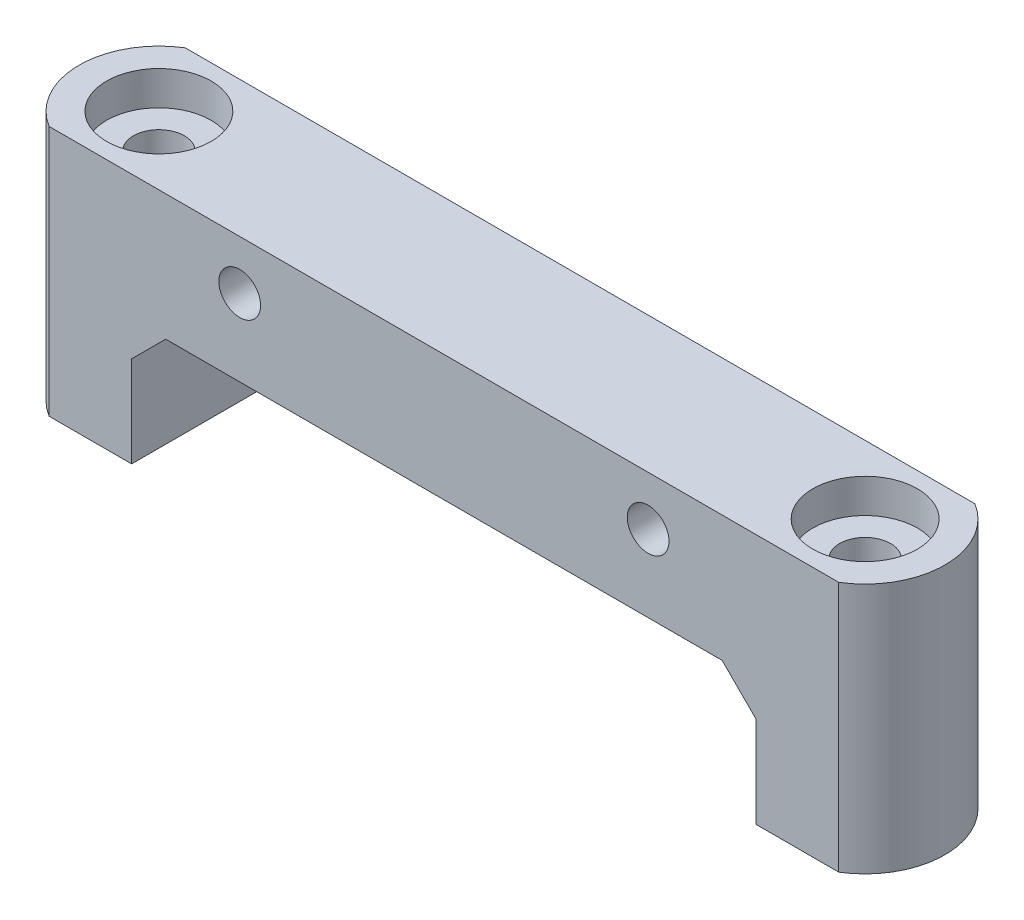
ISO-10303-21;
HEADER;
FILE_DESCRIPTION(('STEP AP214'),'2;1');
FILE_NAME('part.step','',(''),(''),'','','');
FILE_SCHEMA(('AUTOMOTIVE_DESIGN { 1 0 10303 214 1 1 1 1 }'));
ENDSEC;
DATA;
#1=APPLICATION_CONTEXT('core data for automotive mechanical design processes');
#2=APPLICATION_PROTOCOL_DEFINITION('international standard','automotive_design',2000,#1);
#3=PRODUCT_CONTEXT('',#1,'mechanical');
#4=PRODUCT('Part','Part','',(#3));
#5=PRODUCT_RELATED_PRODUCT_CATEGORY('part','',(#4));
#6=PRODUCT_DEFINITION_FORMATION('','',#4);
#7=PRODUCT_DEFINITION_CONTEXT('part definition',#1,'design');
#8=PRODUCT_DEFINITION('design','',#6,#7);
#9=PRODUCT_DEFINITION_SHAPE('','',#8);
#10=(LENGTH_UNIT() NAMED_UNIT(*) SI_UNIT(.MILLI.,.METRE.));
#11=(NAMED_UNIT(*) PLANE_ANGLE_UNIT() SI_UNIT($,.RADIAN.));
#12=(NAMED_UNIT(*) SI_UNIT($,.STERADIAN.) SOLID_ANGLE_UNIT());
#13=UNCERTAINTY_MEASURE_WITH_UNIT(LENGTH_MEASURE(1.E-05),#10,'distance_accuracy_value','');
#14=(GEOMETRIC_REPRESENTATION_CONTEXT(3) GLOBAL_UNCERTAINTY_ASSIGNED_CONTEXT((#13)) GLOBAL_UNIT_ASSIGNED_CONTEXT((#10,
#11,#12)) REPRESENTATION_CONTEXT('',''));
#15=CARTESIAN_POINT('',(0.,0.,0.));
#16=DIRECTION('',(0.,0.,1.));
#17=DIRECTION('',(1.,0.,0.));
#18=AXIS2_PLACEMENT_3D('',#15,#16,#17);
#19=CARTESIAN_POINT('',(-12.,11.85,8.));
#20=DIRECTION('',(0.,0.,-1.));
#21=DIRECTION('',(-1.,0.,0.));
#22=AXIS2_PLACEMENT_3D('',#19,#20,#21);
#23=CYLINDRICAL_SURFACE('',#22,1.);
#24=CARTESIAN_POINT('',(-12.,11.85,0.));
#25=DIRECTION('',(0.,0.,1.));
#26=DIRECTION('',(1.,0.,0.));
#27=AXIS2_PLACEMENT_3D('',#24,#25,#26);
#28=CIRCLE('',#27,1.);
#29=CARTESIAN_POINT('',(-11.,11.85,0.));
#30=VERTEX_POINT('',#29);
#31=EDGE_CURVE('E145',#30,#30,#28,.T.);
#32=ORIENTED_EDGE('',*,*,#31,.F.);
#33=EDGE_LOOP('',(#32));
#34=FACE_BOUND('',#33,.T.);
#35=CARTESIAN_POINT('',(-12.,11.85,3.));
#36=DIRECTION('',(0.,0.,1.));
#37=DIRECTION('',(1.,0.,0.));
#38=AXIS2_PLACEMENT_3D('',#35,#36,#37);
#39=CIRCLE('',#38,1.);
#40=CARTESIAN_POINT('',(-11.,11.85,3.));
#41=VERTEX_POINT('',#40);
#42=EDGE_CURVE('E37',#41,#41,#39,.T.);
#43=ORIENTED_EDGE('',*,*,#42,.T.);
#44=EDGE_LOOP('',(#43));
#45=FACE_BOUND('',#44,.T.);
#46=ADVANCED_FACE('F33',(#34,#45),#23,.F.);
#47=CARTESIAN_POINT('',(12.,11.85,8.));
#48=DIRECTION('',(0.,0.,-1.));
#49=DIRECTION('',(-1.,0.,0.));
#50=AXIS2_PLACEMENT_3D('',#47,#48,#49);
#51=CYLINDRICAL_SURFACE('',#50,1.);
#52=CARTESIAN_POINT('',(12.,11.85,0.));
#53=DIRECTION('',(0.,0.,1.));
#54=DIRECTION('',(1.,0.,0.));
#55=AXIS2_PLACEMENT_3D('',#52,#53,#54);
#56=CIRCLE('',#55,1.);
#57=CARTESIAN_POINT('',(13.,11.85,0.));
#58=VERTEX_POINT('',#57);
#59=EDGE_CURVE('E226',#58,#58,#56,.T.);
#60=ORIENTED_EDGE('',*,*,#59,.F.);
#61=EDGE_LOOP('',(#60));
#62=FACE_BOUND('',#61,.T.);
#63=CARTESIAN_POINT('',(12.,11.85,3.));
#64=DIRECTION('',(0.,0.,1.));
#65=DIRECTION('',(1.,0.,0.));
#66=AXIS2_PLACEMENT_3D('',#63,#64,#65);
#67=CIRCLE('',#66,1.);
#68=CARTESIAN_POINT('',(13.,11.85,3.));
#69=VERTEX_POINT('',#68);
#70=EDGE_CURVE('E193',#69,#69,#67,.T.);
#71=ORIENTED_EDGE('',*,*,#70,.T.);
#72=EDGE_LOOP('',(#71));
#73=FACE_BOUND('',#72,.T.);
#74=ADVANCED_FACE('F281',(#62,#73),#51,.F.);
#75=CARTESIAN_POINT('',(-20.75,14.75,4.));
#76=DIRECTION('',(0.,-1.,0.));
#77=DIRECTION('',(1.,0.,0.));
#78=AXIS2_PLACEMENT_3D('',#75,#76,#77);
#79=CYLINDRICAL_SURFACE('',#78,1.5);
#80=CARTESIAN_POINT('',(-20.75,0.,4.));
#81=DIRECTION('',(0.,-1.,0.));
#82=DIRECTION('',(1.,0.,0.));
#83=AXIS2_PLACEMENT_3D('',#80,#81,#82);
#84=CIRCLE('',#83,1.5);
#85=CARTESIAN_POINT('',(-19.25,0.,4.));
#86=VERTEX_POINT('',#85);
#87=EDGE_CURVE('E223',#86,#86,#84,.T.);
#88=ORIENTED_EDGE('',*,*,#87,.T.);
#89=EDGE_LOOP('',(#88));
#90=FACE_BOUND('',#89,.T.);
#91=CARTESIAN_POINT('',(-20.75,12.75,4.));
#92=DIRECTION('',(0.,1.,0.));
#93=DIRECTION('',(-1.,0.,0.));
#94=AXIS2_PLACEMENT_3D('',#91,#92,#93);
#95=CIRCLE('',#94,1.5);
#96=CARTESIAN_POINT('',(-22.25,12.75,4.));
#97=VERTEX_POINT('',#96);
#98=EDGE_CURVE('E171',#97,#97,#95,.F.);
#99=ORIENTED_EDGE('',*,*,#98,.F.);
#100=EDGE_LOOP('',(#99));
#101=FACE_BOUND('',#100,.T.);
#102=ADVANCED_FACE('F287',(#90,#101),#79,.F.);
#103=CARTESIAN_POINT('',(20.75,14.75,4.));
#104=DIRECTION('',(0.,-1.,0.));
#105=DIRECTION('',(1.,0.,0.));
#106=AXIS2_PLACEMENT_3D('',#103,#104,#105);
#107=CYLINDRICAL_SURFACE('',#106,1.5);
#108=CARTESIAN_POINT('',(20.75,0.,4.));
#109=DIRECTION('',(0.,-1.,0.));
#110=DIRECTION('',(1.,0.,0.));
#111=AXIS2_PLACEMENT_3D('',#108,#109,#110);
#112=CIRCLE('',#111,1.5);
#113=CARTESIAN_POINT('',(22.25,0.,4.));
#114=VERTEX_POINT('',#113);
#115=EDGE_CURVE('E221',#114,#114,#112,.T.);
#116=ORIENTED_EDGE('',*,*,#115,.T.);
#117=EDGE_LOOP('',(#116));
#118=FACE_BOUND('',#117,.T.);
#119=CARTESIAN_POINT('',(20.75,12.75,4.));
#120=DIRECTION('',(0.,1.,0.));
#121=DIRECTION('',(-1.,0.,0.));
#122=AXIS2_PLACEMENT_3D('',#119,#120,#121);
#123=CIRCLE('',#122,1.5);
#124=CARTESIAN_POINT('',(19.25,12.75,4.));
#125=VERTEX_POINT('',#124);
#126=EDGE_CURVE('E168',#125,#125,#123,.F.);
#127=ORIENTED_EDGE('',*,*,#126,.F.);
#128=EDGE_LOOP('',(#127));
#129=FACE_BOUND('',#128,.T.);
#130=ADVANCED_FACE('F296',(#118,#129),#107,.F.);
#131=CARTESIAN_POINT('',(0.,0.,8.));
#132=DIRECTION('',(0.,0.,-1.));
#133=DIRECTION('',(-1.,0.,0.));
#134=AXIS2_PLACEMENT_3D('',#131,#132,#133);
#135=PLANE('',#134);
#136=CARTESIAN_POINT('',(-12.,11.85,8.));
#137=DIRECTION('',(0.,0.,1.));
#138=DIRECTION('',(1.,0.,0.));
#139=AXIS2_PLACEMENT_3D('',#136,#137,#138);
#140=CIRCLE('',#139,1.225);
#141=CARTESIAN_POINT('',(-10.775,11.85,8.));
#142=VERTEX_POINT('',#141);
#143=EDGE_CURVE('E201',#142,#142,#140,.T.);
#144=ORIENTED_EDGE('',*,*,#143,.F.);
#145=EDGE_LOOP('',(#144));
#146=FACE_BOUND('',#145,.T.);
#147=CARTESIAN_POINT('',(12.,11.85,8.));
#148=DIRECTION('',(0.,0.,1.));
#149=DIRECTION('',(1.,0.,0.));
#150=AXIS2_PLACEMENT_3D('',#147,#148,#149);
#151=CIRCLE('',#150,1.225);
#152=CARTESIAN_POINT('',(13.225,11.85,8.));
#153=VERTEX_POINT('',#152);
#154=EDGE_CURVE('E211',#153,#153,#151,.T.);
#155=ORIENTED_EDGE('',*,*,#154,.F.);
#156=EDGE_LOOP('',(#155));
#157=FACE_BOUND('',#156,.T.);
#158=DIRECTION('',(0.,1.,0.));
#159=VECTOR('',#158,1.);
#160=CARTESIAN_POINT('',(-18.35,7.35,8.));
#161=LINE('',#160,#159);
#162=CARTESIAN_POINT('',(-18.35,0.,8.));
#163=VERTEX_POINT('',#162);
#164=CARTESIAN_POINT('',(-18.35,5.34999999999999,8.));
#165=VERTEX_POINT('',#164);
#166=EDGE_CURVE('E136',#163,#165,#161,.T.);
#167=ORIENTED_EDGE('',*,*,#166,.T.);
#168=DIRECTION('',(-0.707106781186551,-0.707106781186544,0.));
#169=VECTOR('',#168,1.);
#170=CARTESIAN_POINT('',(-11.8499999999999,11.85,8.));
#171=LINE('',#170,#169);
#172=CARTESIAN_POINT('',(-16.35,7.35,8.));
#173=VERTEX_POINT('',#172);
#174=EDGE_CURVE('E191',#165,#173,#171,.F.);
#175=ORIENTED_EDGE('',*,*,#174,.T.);
#176=DIRECTION('',(1.,0.,0.));
#177=VECTOR('',#176,1.);
#178=CARTESIAN_POINT('',(-18.35,7.35,8.));
#179=LINE('',#178,#177);
#180=CARTESIAN_POINT('',(16.35,7.35,8.));
#181=VERTEX_POINT('',#180);
#182=EDGE_CURVE('E162',#173,#181,#179,.T.);
#183=ORIENTED_EDGE('',*,*,#182,.T.);
#184=DIRECTION('',(-0.707106781186543,0.707106781186552,0.));
#185=VECTOR('',#184,1.);
#186=CARTESIAN_POINT('',(11.8500000000001,11.85,8.));
#187=LINE('',#186,#185);
#188=CARTESIAN_POINT('',(18.35,5.34999999999998,8.));
#189=VERTEX_POINT('',#188);
#190=EDGE_CURVE('E11',#181,#189,#187,.F.);
#191=ORIENTED_EDGE('',*,*,#190,.T.);
#192=DIRECTION('',(0.,-1.,0.));
#193=VECTOR('',#192,1.);
#194=CARTESIAN_POINT('',(18.35,7.35,8.));
#195=LINE('',#194,#193);
#196=CARTESIAN_POINT('',(18.35,0.,8.));
#197=VERTEX_POINT('',#196);
#198=EDGE_CURVE('E234',#189,#197,#195,.T.);
#199=ORIENTED_EDGE('',*,*,#198,.T.);
#200=DIRECTION('',(1.,0.,0.));
#201=VECTOR('',#200,1.);
#202=CARTESIAN_POINT('',(23.2,0.,8.));
#203=LINE('',#202,#201);
#204=CARTESIAN_POINT('',(23.2,0.,8.));
#205=VERTEX_POINT('',#204);
#206=EDGE_CURVE('E236',#197,#205,#203,.T.);
#207=ORIENTED_EDGE('',*,*,#206,.T.);
#208=DIRECTION('',(0.,1.,0.));
#209=VECTOR('',#208,1.);
#210=CARTESIAN_POINT('',(23.2,14.75,8.));
#211=LINE('',#210,#209);
#212=CARTESIAN_POINT('',(23.2,14.75,8.));
#213=VERTEX_POINT('',#212);
#214=EDGE_CURVE('E239',#205,#213,#211,.T.);
#215=ORIENTED_EDGE('',*,*,#214,.T.);
#216=DIRECTION('',(-1.,0.,0.));
#217=VECTOR('',#216,1.);
#218=CARTESIAN_POINT('',(-23.2,14.75,8.));
#219=LINE('',#218,#217);
#220=CARTESIAN_POINT('',(-23.2,14.75,8.));
#221=VERTEX_POINT('',#220);
#222=EDGE_CURVE('E130',#213,#221,#219,.T.);
#223=ORIENTED_EDGE('',*,*,#222,.T.);
#224=DIRECTION('',(0.,-1.,0.));
#225=VECTOR('',#224,1.);
#226=CARTESIAN_POINT('',(-23.2,0.,8.));
#227=LINE('',#226,#225);
#228=CARTESIAN_POINT('',(-23.2,0.,8.));
#229=VERTEX_POINT('',#228);
#230=EDGE_CURVE('E113',#221,#229,#227,.T.);
#231=ORIENTED_EDGE('',*,*,#230,.T.);
#232=DIRECTION('',(1.,0.,0.));
#233=VECTOR('',#232,1.);
#234=CARTESIAN_POINT('',(-18.35,0.,8.));
#235=LINE('',#234,#233);
#236=EDGE_CURVE('E126',#229,#163,#235,.T.);
#237=ORIENTED_EDGE('',*,*,#236,.T.);
#238=EDGE_LOOP('',(#167,#175,#183,#191,#199,#207,#215,#223,#231,#237));
#239=FACE_BOUND('',#238,.T.);
#240=ADVANCED_FACE('F125',(#146,#157,#239),#135,.F.);
#241=CARTESIAN_POINT('',(0.,0.,0.));
#242=DIRECTION('',(0.,0.,-1.));
#243=DIRECTION('',(-1.,0.,0.));
#244=AXIS2_PLACEMENT_3D('',#241,#242,#243);
#245=PLANE('',#244);
#246=ORIENTED_EDGE('',*,*,#31,.T.);
#247=EDGE_LOOP('',(#246));
#248=FACE_BOUND('',#247,.T.);
#249=DIRECTION('',(1.,0.,0.));
#250=VECTOR('',#249,1.);
#251=CARTESIAN_POINT('',(-18.35,7.35,0.));
#252=LINE('',#251,#250);
#253=CARTESIAN_POINT('',(-16.35,7.35,0.));
#254=VERTEX_POINT('',#253);
#255=CARTESIAN_POINT('',(16.35,7.35,0.));
#256=VERTEX_POINT('',#255);
#257=EDGE_CURVE('E141',#254,#256,#252,.T.);
#258=ORIENTED_EDGE('',*,*,#257,.F.);
#259=DIRECTION('',(0.707106781186551,0.707106781186544,0.));
#260=VECTOR('',#259,1.);
#261=CARTESIAN_POINT('',(-16.35,7.35,0.));
#262=LINE('',#261,#260);
#263=CARTESIAN_POINT('',(-18.35,5.34999999999999,0.));
#264=VERTEX_POINT('',#263);
#265=EDGE_CURVE('E189',#254,#264,#262,.F.);
#266=ORIENTED_EDGE('',*,*,#265,.T.);
#267=DIRECTION('',(0.,1.,0.));
#268=VECTOR('',#267,1.);
#269=CARTESIAN_POINT('',(-18.35,7.35,0.));
#270=LINE('',#269,#268);
#271=CARTESIAN_POINT('',(-18.35,0.,0.));
#272=VERTEX_POINT('',#271);
#273=EDGE_CURVE('E159',#272,#264,#270,.T.);
#274=ORIENTED_EDGE('',*,*,#273,.F.);
#275=DIRECTION('',(1.,0.,0.));
#276=VECTOR('',#275,1.);
#277=CARTESIAN_POINT('',(-18.35,0.,0.));
#278=LINE('',#277,#276);
#279=CARTESIAN_POINT('',(-23.2,0.,0.));
#280=VERTEX_POINT('',#279);
#281=EDGE_CURVE('E157',#280,#272,#278,.T.);
#282=ORIENTED_EDGE('',*,*,#281,.F.);
#283=DIRECTION('',(0.,-1.,0.));
#284=VECTOR('',#283,1.);
#285=CARTESIAN_POINT('',(-23.2,0.,0.));
#286=LINE('',#285,#284);
#287=CARTESIAN_POINT('',(-23.2,14.75,0.));
#288=VERTEX_POINT('',#287);
#289=EDGE_CURVE('E116',#288,#280,#286,.T.);
#290=ORIENTED_EDGE('',*,*,#289,.F.);
#291=DIRECTION('',(-1.,0.,0.));
#292=VECTOR('',#291,1.);
#293=CARTESIAN_POINT('',(-23.2,14.75,0.));
#294=LINE('',#293,#292);
#295=CARTESIAN_POINT('',(23.2,14.75,0.));
#296=VERTEX_POINT('',#295);
#297=EDGE_CURVE('E153',#296,#288,#294,.T.);
#298=ORIENTED_EDGE('',*,*,#297,.F.);
#299=DIRECTION('',(0.,1.,0.));
#300=VECTOR('',#299,1.);
#301=CARTESIAN_POINT('',(23.2,14.75,0.));
#302=LINE('',#301,#300);
#303=CARTESIAN_POINT('',(23.2,0.,0.));
#304=VERTEX_POINT('',#303);
#305=EDGE_CURVE('E150',#304,#296,#302,.T.);
#306=ORIENTED_EDGE('',*,*,#305,.F.);
#307=DIRECTION('',(1.,0.,0.));
#308=VECTOR('',#307,1.);
#309=CARTESIAN_POINT('',(23.2,0.,0.));
#310=LINE('',#309,#308);
#311=CARTESIAN_POINT('',(18.35,0.,0.));
#312=VERTEX_POINT('',#311);
#313=EDGE_CURVE('E147',#312,#304,#310,.T.);
#314=ORIENTED_EDGE('',*,*,#313,.F.);
#315=DIRECTION('',(0.,-1.,0.));
#316=VECTOR('',#315,1.);
#317=CARTESIAN_POINT('',(18.35,7.35,0.));
#318=LINE('',#317,#316);
#319=CARTESIAN_POINT('',(18.35,5.34999999999998,0.));
#320=VERTEX_POINT('',#319);
#321=EDGE_CURVE('E144',#320,#312,#318,.T.);
#322=ORIENTED_EDGE('',*,*,#321,.F.);
#323=DIRECTION('',(0.707106781186543,-0.707106781186552,0.));
#324=VECTOR('',#323,1.);
#325=CARTESIAN_POINT('',(18.35,5.34999999999998,0.));
#326=LINE('',#325,#324);
#327=EDGE_CURVE('E42',#320,#256,#326,.F.);
#328=ORIENTED_EDGE('',*,*,#327,.T.);
#329=EDGE_LOOP('',(#258,#266,#274,#282,#290,#298,#306,#314,#322,#328));
#330=FACE_BOUND('',#329,.T.);
#331=ORIENTED_EDGE('',*,*,#59,.T.);
#332=EDGE_LOOP('',(#331));
#333=FACE_BOUND('',#332,.T.);
#334=ADVANCED_FACE('F249',(#248,#330,#333),#245,.T.);
#335=CARTESIAN_POINT('',(-18.35,7.35,8.));
#336=DIRECTION('',(0.,1.,0.));
#337=DIRECTION('',(0.,0.,1.));
#338=AXIS2_PLACEMENT_3D('',#335,#336,#337);
#339=PLANE('',#338);
#340=ORIENTED_EDGE('',*,*,#182,.F.);
#341=DIRECTION('',(0.,0.,-1.));
#342=VECTOR('',#341,1.);
#343=CARTESIAN_POINT('',(-16.35,7.35,0.));
#344=LINE('',#343,#342);
#345=EDGE_CURVE('E182',#173,#254,#344,.T.);
#346=ORIENTED_EDGE('',*,*,#345,.T.);
#347=ORIENTED_EDGE('',*,*,#257,.T.);
#348=DIRECTION('',(0.,0.,1.));
#349=VECTOR('',#348,1.);
#350=CARTESIAN_POINT('',(16.35,7.35,8.));
#351=LINE('',#350,#349);
#352=EDGE_CURVE('E167',#256,#181,#351,.T.);
#353=ORIENTED_EDGE('',*,*,#352,.T.);
#354=EDGE_LOOP('',(#340,#346,#347,#353));
#355=FACE_BOUND('',#354,.T.);
#356=ADVANCED_FACE('F261',(#355),#339,.F.);
#357=CARTESIAN_POINT('',(18.35,7.35,8.));
#358=DIRECTION('',(1.,0.,0.));
#359=DIRECTION('',(0.,0.,-1.));
#360=AXIS2_PLACEMENT_3D('',#357,#358,#359);
#361=PLANE('',#360);
#362=ORIENTED_EDGE('',*,*,#198,.F.);
#363=DIRECTION('',(0.,0.,-1.));
#364=VECTOR('',#363,1.);
#365=CARTESIAN_POINT('',(18.35,5.34999999999998,0.));
#366=LINE('',#365,#364);
#367=EDGE_CURVE('E187',#189,#320,#366,.T.);
#368=ORIENTED_EDGE('',*,*,#367,.T.);
#369=ORIENTED_EDGE('',*,*,#321,.T.);
#370=DIRECTION('',(0.,0.,-1.));
#371=VECTOR('',#370,1.);
#372=CARTESIAN_POINT('',(18.35,0.,8.));
#373=LINE('',#372,#371);
#374=EDGE_CURVE('E164',#197,#312,#373,.T.);
#375=ORIENTED_EDGE('',*,*,#374,.F.);
#376=EDGE_LOOP('',(#362,#368,#369,#375));
#377=FACE_BOUND('',#376,.T.);
#378=ADVANCED_FACE('F266',(#377),#361,.F.);
#379=CARTESIAN_POINT('',(23.2,0.,8.));
#380=DIRECTION('',(0.,1.,0.));
#381=DIRECTION('',(-1.,0.,0.));
#382=AXIS2_PLACEMENT_3D('',#379,#380,#381);
#383=PLANE('',#382);
#384=ORIENTED_EDGE('',*,*,#115,.F.);
#385=EDGE_LOOP('',(#384));
#386=FACE_BOUND('',#385,.T.);
#387=ORIENTED_EDGE('',*,*,#313,.T.);
#388=CARTESIAN_POINT('',(20.75,0.,4.));
#389=DIRECTION('',(0.,1.,0.));
#390=DIRECTION('',(-1.,0.,0.));
#391=AXIS2_PLACEMENT_3D('',#388,#389,#390);
#392=CIRCLE('',#391,4.69068225314826);
#393=EDGE_CURVE('E219',#205,#304,#392,.T.);
#394=ORIENTED_EDGE('',*,*,#393,.F.);
#395=ORIENTED_EDGE('',*,*,#206,.F.);
#396=ORIENTED_EDGE('',*,*,#374,.T.);
#397=EDGE_LOOP('',(#387,#394,#395,#396));
#398=FACE_BOUND('',#397,.T.);
#399=ADVANCED_FACE('F268',(#386,#398),#383,.F.);
#400=CARTESIAN_POINT('',(-23.2,14.75,8.));
#401=DIRECTION('',(0.,-1.,0.));
#402=DIRECTION('',(1.,0.,0.));
#403=AXIS2_PLACEMENT_3D('',#400,#401,#402);
#404=PLANE('',#403);
#405=CARTESIAN_POINT('',(20.75,14.75,4.));
#406=DIRECTION('',(0.,-1.,0.));
#407=DIRECTION('',(1.,0.,0.));
#408=AXIS2_PLACEMENT_3D('',#405,#406,#407);
#409=CIRCLE('',#408,3.075);
#410=CARTESIAN_POINT('',(23.825,14.75,4.));
#411=VERTEX_POINT('',#410);
#412=EDGE_CURVE('E178',#411,#411,#409,.F.);
#413=ORIENTED_EDGE('',*,*,#412,.F.);
#414=EDGE_LOOP('',(#413));
#415=FACE_BOUND('',#414,.T.);
#416=CARTESIAN_POINT('',(-20.75,14.75,4.));
#417=DIRECTION('',(0.,-1.,0.));
#418=DIRECTION('',(1.,0.,0.));
#419=AXIS2_PLACEMENT_3D('',#416,#417,#418);
#420=CIRCLE('',#419,3.075);
#421=CARTESIAN_POINT('',(-17.675,14.75,4.));
#422=VERTEX_POINT('',#421);
#423=EDGE_CURVE('E175',#422,#422,#420,.F.);
#424=ORIENTED_EDGE('',*,*,#423,.F.);
#425=EDGE_LOOP('',(#424));
#426=FACE_BOUND('',#425,.T.);
#427=ORIENTED_EDGE('',*,*,#297,.T.);
#428=CARTESIAN_POINT('',(-20.75,14.75,4.));
#429=DIRECTION('',(0.,1.,0.));
#430=DIRECTION('',(-1.,0.,0.));
#431=AXIS2_PLACEMENT_3D('',#428,#429,#430);
#432=CIRCLE('',#431,4.69068225314826);
#433=EDGE_CURVE('E121',#288,#221,#432,.T.);
#434=ORIENTED_EDGE('',*,*,#433,.T.);
#435=ORIENTED_EDGE('',*,*,#222,.F.);
#436=CARTESIAN_POINT('',(20.75,14.75,4.));
#437=DIRECTION('',(0.,1.,0.));
#438=DIRECTION('',(-1.,0.,0.));
#439=AXIS2_PLACEMENT_3D('',#436,#437,#438);
#440=CIRCLE('',#439,4.69068225314826);
#441=EDGE_CURVE('E120',#213,#296,#440,.T.);
#442=ORIENTED_EDGE('',*,*,#441,.T.);
#443=EDGE_LOOP('',(#427,#434,#435,#442));
#444=FACE_BOUND('',#443,.T.);
#445=ADVANCED_FACE('F244',(#415,#426,#444),#404,.F.);
#446=CARTESIAN_POINT('',(-18.35,0.,8.));
#447=DIRECTION('',(0.,1.,0.));
#448=DIRECTION('',(-1.,0.,0.));
#449=AXIS2_PLACEMENT_3D('',#446,#447,#448);
#450=PLANE('',#449);
#451=ORIENTED_EDGE('',*,*,#87,.F.);
#452=EDGE_LOOP('',(#451));
#453=FACE_BOUND('',#452,.T.);
#454=ORIENTED_EDGE('',*,*,#281,.T.);
#455=DIRECTION('',(0.,0.,-1.));
#456=VECTOR('',#455,1.);
#457=CARTESIAN_POINT('',(-18.35,0.,8.));
#458=LINE('',#457,#456);
#459=EDGE_CURVE('E134',#163,#272,#458,.T.);
#460=ORIENTED_EDGE('',*,*,#459,.F.);
#461=ORIENTED_EDGE('',*,*,#236,.F.);
#462=CARTESIAN_POINT('',(-20.75,0.,4.));
#463=DIRECTION('',(0.,1.,0.));
#464=DIRECTION('',(-1.,0.,0.));
#465=AXIS2_PLACEMENT_3D('',#462,#463,#464);
#466=CIRCLE('',#465,4.69068225314826);
#467=EDGE_CURVE('E110',#280,#229,#466,.T.);
#468=ORIENTED_EDGE('',*,*,#467,.F.);
#469=EDGE_LOOP('',(#454,#460,#461,#468));
#470=FACE_BOUND('',#469,.T.);
#471=ADVANCED_FACE('F132',(#453,#470),#450,.F.);
#472=CARTESIAN_POINT('',(-18.35,7.35,8.));
#473=DIRECTION('',(-1.,0.,0.));
#474=DIRECTION('',(0.,0.,1.));
#475=AXIS2_PLACEMENT_3D('',#472,#473,#474);
#476=PLANE('',#475);
#477=ORIENTED_EDGE('',*,*,#273,.T.);
#478=DIRECTION('',(0.,0.,1.));
#479=VECTOR('',#478,1.);
#480=CARTESIAN_POINT('',(-18.35,5.34999999999999,8.));
#481=LINE('',#480,#479);
#482=EDGE_CURVE('E185',#264,#165,#481,.T.);
#483=ORIENTED_EDGE('',*,*,#482,.T.);
#484=ORIENTED_EDGE('',*,*,#166,.F.);
#485=ORIENTED_EDGE('',*,*,#459,.T.);
#486=EDGE_LOOP('',(#477,#483,#484,#485));
#487=FACE_BOUND('',#486,.T.);
#488=ADVANCED_FACE('F253',(#487),#476,.F.);
#489=CARTESIAN_POINT('',(20.75,0.,4.));
#490=DIRECTION('',(0.,1.,0.));
#491=DIRECTION('',(-1.,0.,0.));
#492=AXIS2_PLACEMENT_3D('',#489,#490,#491);
#493=CYLINDRICAL_SURFACE('',#492,4.69068225314826);
#494=ORIENTED_EDGE('',*,*,#441,.F.);
#495=ORIENTED_EDGE('',*,*,#214,.F.);
#496=ORIENTED_EDGE('',*,*,#393,.T.);
#497=ORIENTED_EDGE('',*,*,#305,.T.);
#498=EDGE_LOOP('',(#494,#495,#496,#497));
#499=FACE_BOUND('',#498,.T.);
#500=ADVANCED_FACE('F269',(#499),#493,.T.);
#501=CARTESIAN_POINT('',(-20.75,0.,4.));
#502=DIRECTION('',(0.,1.,0.));
#503=DIRECTION('',(-1.,0.,0.));
#504=AXIS2_PLACEMENT_3D('',#501,#502,#503);
#505=CYLINDRICAL_SURFACE('',#504,4.69068225314826);
#506=ORIENTED_EDGE('',*,*,#433,.F.);
#507=ORIENTED_EDGE('',*,*,#289,.T.);
#508=ORIENTED_EDGE('',*,*,#467,.T.);
#509=ORIENTED_EDGE('',*,*,#230,.F.);
#510=EDGE_LOOP('',(#506,#507,#508,#509));
#511=FACE_BOUND('',#510,.T.);
#512=ADVANCED_FACE('F112',(#511),#505,.T.);
#513=CARTESIAN_POINT('',(20.75,14.750012,4.));
#514=DIRECTION('',(0.,-1.,0.));
#515=DIRECTION('',(1.,0.,0.));
#516=AXIS2_PLACEMENT_3D('',#513,#514,#515);
#517=CYLINDRICAL_SURFACE('',#516,3.075);
#518=CARTESIAN_POINT('',(20.75,12.75,4.));
#519=DIRECTION('',(0.,1.,0.));
#520=DIRECTION('',(-1.,0.,0.));
#521=AXIS2_PLACEMENT_3D('',#518,#519,#520);
#522=CIRCLE('',#521,3.075);
#523=CARTESIAN_POINT('',(17.675,12.75,4.));
#524=VERTEX_POINT('',#523);
#525=EDGE_CURVE('E172',#524,#524,#522,.T.);
#526=ORIENTED_EDGE('',*,*,#525,.F.);
#527=EDGE_LOOP('',(#526));
#528=FACE_BOUND('',#527,.T.);
#529=ORIENTED_EDGE('',*,*,#412,.T.);
#530=EDGE_LOOP('',(#529));
#531=FACE_BOUND('',#530,.T.);
#532=ADVANCED_FACE('F276',(#528,#531),#517,.F.);
#533=CARTESIAN_POINT('',(20.75,12.75,4.));
#534=DIRECTION('',(0.,1.,0.));
#535=DIRECTION('',(-1.,0.,0.));
#536=AXIS2_PLACEMENT_3D('',#533,#534,#535);
#537=PLANE('',#536);
#538=ORIENTED_EDGE('',*,*,#525,.T.);
#539=EDGE_LOOP('',(#538));
#540=FACE_BOUND('',#539,.T.);
#541=ORIENTED_EDGE('',*,*,#126,.T.);
#542=EDGE_LOOP('',(#541));
#543=FACE_BOUND('',#542,.T.);
#544=ADVANCED_FACE('F326',(#540,#543),#537,.T.);
#545=CARTESIAN_POINT('',(-20.75,14.750012,4.));
#546=DIRECTION('',(0.,-1.,0.));
#547=DIRECTION('',(1.,0.,0.));
#548=AXIS2_PLACEMENT_3D('',#545,#546,#547);
#549=CYLINDRICAL_SURFACE('',#548,3.075);
#550=CARTESIAN_POINT('',(-20.75,12.75,4.));
#551=DIRECTION('',(0.,1.,0.));
#552=DIRECTION('',(-1.,0.,0.));
#553=AXIS2_PLACEMENT_3D('',#550,#551,#552);
#554=CIRCLE('',#553,3.075);
#555=CARTESIAN_POINT('',(-23.825,12.75,4.));
#556=VERTEX_POINT('',#555);
#557=EDGE_CURVE('E199',#556,#556,#554,.T.);
#558=ORIENTED_EDGE('',*,*,#557,.F.);
#559=EDGE_LOOP('',(#558));
#560=FACE_BOUND('',#559,.T.);
#561=ORIENTED_EDGE('',*,*,#423,.T.);
#562=EDGE_LOOP('',(#561));
#563=FACE_BOUND('',#562,.T.);
#564=ADVANCED_FACE('F320',(#560,#563),#549,.F.);
#565=CARTESIAN_POINT('',(-20.75,12.75,4.));
#566=DIRECTION('',(0.,1.,0.));
#567=DIRECTION('',(-1.,0.,0.));
#568=AXIS2_PLACEMENT_3D('',#565,#566,#567);
#569=PLANE('',#568);
#570=ORIENTED_EDGE('',*,*,#557,.T.);
#571=EDGE_LOOP('',(#570));
#572=FACE_BOUND('',#571,.T.);
#573=ORIENTED_EDGE('',*,*,#98,.T.);
#574=EDGE_LOOP('',(#573));
#575=FACE_BOUND('',#574,.T.);
#576=ADVANCED_FACE('F314',(#572,#575),#569,.T.);
#577=CARTESIAN_POINT('',(-16.35,7.35,8.));
#578=DIRECTION('',(0.707106781186544,-0.707106781186551,0.));
#579=DIRECTION('',(0.,0.,1.));
#580=AXIS2_PLACEMENT_3D('',#577,#578,#579);
#581=PLANE('',#580);
#582=ORIENTED_EDGE('',*,*,#174,.F.);
#583=ORIENTED_EDGE('',*,*,#482,.F.);
#584=ORIENTED_EDGE('',*,*,#265,.F.);
#585=ORIENTED_EDGE('',*,*,#345,.F.);
#586=EDGE_LOOP('',(#582,#583,#584,#585));
#587=FACE_BOUND('',#586,.T.);
#588=ADVANCED_FACE('F259',(#587),#581,.T.);
#589=CARTESIAN_POINT('',(18.35,5.34999999999998,8.));
#590=DIRECTION('',(-0.707106781186552,-0.707106781186543,0.));
#591=DIRECTION('',(0.,0.,1.));
#592=AXIS2_PLACEMENT_3D('',#589,#590,#591);
#593=PLANE('',#592);
#594=ORIENTED_EDGE('',*,*,#190,.F.);
#595=ORIENTED_EDGE('',*,*,#352,.F.);
#596=ORIENTED_EDGE('',*,*,#327,.F.);
#597=ORIENTED_EDGE('',*,*,#367,.F.);
#598=EDGE_LOOP('',(#594,#595,#596,#597));
#599=FACE_BOUND('',#598,.T.);
#600=ADVANCED_FACE('F35',(#599),#593,.T.);
#601=CARTESIAN_POINT('',(12.,11.85,3.));
#602=DIRECTION('',(0.,0.,1.));
#603=DIRECTION('',(1.,0.,0.));
#604=AXIS2_PLACEMENT_3D('',#601,#602,#603);
#605=CYLINDRICAL_SURFACE('',#604,1.225);
#606=CARTESIAN_POINT('',(12.,11.85,3.));
#607=DIRECTION('',(0.,0.,1.));
#608=DIRECTION('',(1.,0.,0.));
#609=AXIS2_PLACEMENT_3D('',#606,#607,#608);
#610=CIRCLE('',#609,1.225);
#611=CARTESIAN_POINT('',(13.225,11.85,3.));
#612=VERTEX_POINT('',#611);
#613=EDGE_CURVE('E206',#612,#612,#610,.T.);
#614=ORIENTED_EDGE('',*,*,#613,.F.);
#615=EDGE_LOOP('',(#614));
#616=FACE_BOUND('',#615,.T.);
#617=ORIENTED_EDGE('',*,*,#154,.T.);
#618=EDGE_LOOP('',(#617));
#619=FACE_BOUND('',#618,.T.);
#620=ADVANCED_FACE('F319',(#616,#619),#605,.F.);
#621=CARTESIAN_POINT('',(12.,11.85,3.));
#622=DIRECTION('',(0.,0.,1.));
#623=DIRECTION('',(1.,0.,0.));
#624=AXIS2_PLACEMENT_3D('',#621,#622,#623);
#625=PLANE('',#624);
#626=ORIENTED_EDGE('',*,*,#70,.F.);
#627=EDGE_LOOP('',(#626));
#628=FACE_BOUND('',#627,.T.);
#629=ORIENTED_EDGE('',*,*,#613,.T.);
#630=EDGE_LOOP('',(#629));
#631=FACE_BOUND('',#630,.T.);
#632=ADVANCED_FACE('F339',(#628,#631),#625,.T.);
#633=CARTESIAN_POINT('',(-12.,11.85,3.));
#634=DIRECTION('',(0.,0.,1.));
#635=DIRECTION('',(1.,0.,0.));
#636=AXIS2_PLACEMENT_3D('',#633,#634,#635);
#637=CYLINDRICAL_SURFACE('',#636,1.225);
#638=CARTESIAN_POINT('',(-12.,11.85,3.));
#639=DIRECTION('',(0.,0.,1.));
#640=DIRECTION('',(1.,0.,0.));
#641=AXIS2_PLACEMENT_3D('',#638,#639,#640);
#642=CIRCLE('',#641,1.225);
#643=CARTESIAN_POINT('',(-10.775,11.85,3.));
#644=VERTEX_POINT('',#643);
#645=EDGE_CURVE('E195',#644,#644,#642,.T.);
#646=ORIENTED_EDGE('',*,*,#645,.F.);
#647=EDGE_LOOP('',(#646));
#648=FACE_BOUND('',#647,.T.);
#649=ORIENTED_EDGE('',*,*,#143,.T.);
#650=EDGE_LOOP('',(#649));
#651=FACE_BOUND('',#650,.T.);
#652=ADVANCED_FACE('F343',(#648,#651),#637,.F.);
#653=CARTESIAN_POINT('',(-12.,11.85,3.));
#654=DIRECTION('',(0.,0.,1.));
#655=DIRECTION('',(1.,0.,0.));
#656=AXIS2_PLACEMENT_3D('',#653,#654,#655);
#657=PLANE('',#656);
#658=ORIENTED_EDGE('',*,*,#42,.F.);
#659=EDGE_LOOP('',(#658));
#660=FACE_BOUND('',#659,.T.);
#661=ORIENTED_EDGE('',*,*,#645,.T.);
#662=EDGE_LOOP('',(#661));
#663=FACE_BOUND('',#662,.T.);
#664=ADVANCED_FACE('F347',(#660,#663),#657,.T.);
#665=CLOSED_SHELL('',(#46,#74,#102,#130,#240,#334,#356,#378,#399,#445,#471,#488,#500,#512,#532,
#544,#564,#576,#588,#600,#620,#632,#652,#664));
#666=MANIFOLD_SOLID_BREP('B2',#665);
#667=ADVANCED_BREP_SHAPE_REPRESENTATION('',(#18,#666),#14);
#668=SHAPE_DEFINITION_REPRESENTATION(#9,#667);
ENDSEC;
END-ISO-10303-21;
